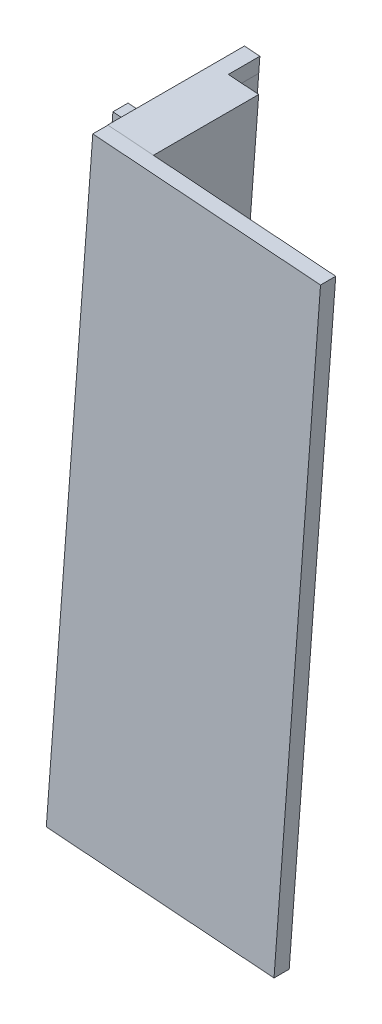
ISO-10303-21;
HEADER;
FILE_DESCRIPTION(('STEP AP214'),'2;1');
FILE_NAME('part.step','',(''),(''),'','','');
FILE_SCHEMA(('AUTOMOTIVE_DESIGN { 1 0 10303 214 1 1 1 1 }'));
ENDSEC;
DATA;
#1=APPLICATION_CONTEXT('core data for automotive mechanical design processes');
#2=APPLICATION_PROTOCOL_DEFINITION('international standard','automotive_design',2000,#1);
#3=PRODUCT_CONTEXT('',#1,'mechanical');
#4=PRODUCT('Part','Part','',(#3));
#5=PRODUCT_RELATED_PRODUCT_CATEGORY('part','',(#4));
#6=PRODUCT_DEFINITION_FORMATION('','',#4);
#7=PRODUCT_DEFINITION_CONTEXT('part definition',#1,'design');
#8=PRODUCT_DEFINITION('design','',#6,#7);
#9=PRODUCT_DEFINITION_SHAPE('','',#8);
#10=(LENGTH_UNIT() NAMED_UNIT(*) SI_UNIT(.MILLI.,.METRE.));
#11=(NAMED_UNIT(*) PLANE_ANGLE_UNIT() SI_UNIT($,.RADIAN.));
#12=(NAMED_UNIT(*) SI_UNIT($,.STERADIAN.) SOLID_ANGLE_UNIT());
#13=UNCERTAINTY_MEASURE_WITH_UNIT(LENGTH_MEASURE(1.E-05),#10,'distance_accuracy_value','');
#14=(GEOMETRIC_REPRESENTATION_CONTEXT(3) GLOBAL_UNCERTAINTY_ASSIGNED_CONTEXT((#13)) GLOBAL_UNIT_ASSIGNED_CONTEXT((#10,
#11,#12)) REPRESENTATION_CONTEXT('',''));
#15=CARTESIAN_POINT('',(0.,0.,0.));
#16=DIRECTION('',(0.,0.,1.));
#17=DIRECTION('',(1.,0.,0.));
#18=AXIS2_PLACEMENT_3D('',#15,#16,#17);
#19=CARTESIAN_POINT('',(0.,0.,0.));
#20=DIRECTION('',(0.,0.,1.));
#21=DIRECTION('',(1.,0.,0.));
#22=AXIS2_PLACEMENT_3D('',#19,#20,#21);
#23=PLANE('',#22);
#24=CARTESIAN_POINT('',(-4.41257913039612,-11.3464754526744,0.));
#25=DIRECTION('',(0.,0.,1.));
#26=DIRECTION('',(1.,0.,0.));
#27=AXIS2_PLACEMENT_3D('',#24,#25,#26);
#28=CIRCLE('',#27,2.00091326218377);
#29=CARTESIAN_POINT('',(-2.41166586821235,-11.3464754526744,0.));
#30=VERTEX_POINT('',#29);
#31=EDGE_CURVE('E390',#30,#30,#28,.T.);
#32=ORIENTED_EDGE('',*,*,#31,.T.);
#33=EDGE_LOOP('',(#32));
#34=FACE_BOUND('',#33,.T.);
#35=CARTESIAN_POINT('',(-5.84800890611934,-30.5837880858479,0.));
#36=DIRECTION('',(0.,0.,1.));
#37=DIRECTION('',(1.,0.,0.));
#38=AXIS2_PLACEMENT_3D('',#35,#36,#37);
#39=CIRCLE('',#38,2.00091326218377);
#40=CARTESIAN_POINT('',(-3.84709564393557,-30.5837880858479,0.));
#41=VERTEX_POINT('',#40);
#42=EDGE_CURVE('E384',#41,#41,#39,.T.);
#43=ORIENTED_EDGE('',*,*,#42,.T.);
#44=EDGE_LOOP('',(#43));
#45=FACE_BOUND('',#44,.T.);
#46=DIRECTION('',(-0.074410100721773,-0.997227725702899,0.));
#47=VECTOR('',#46,1.);
#48=CARTESIAN_POINT('',(1.01318336931414,-0.0756006623333213,0.));
#49=LINE('',#48,#47);
#50=CARTESIAN_POINT('',(0.937582861690444,-1.08878195826331,0.));
#51=VERTEX_POINT('',#50);
#52=CARTESIAN_POINT('',(-1.97304269494848,-40.0963424381601,0.));
#53=VERTEX_POINT('',#52);
#54=EDGE_CURVE('E284',#51,#53,#49,.T.);
#55=ORIENTED_EDGE('',*,*,#54,.T.);
#56=DIRECTION('',(-0.0744080599923074,-0.997227877973827,0.));
#57=VECTOR('',#56,1.);
#58=CARTESIAN_POINT('',(1.01310162546081,-0.0755924780991435,0.));
#59=LINE('',#58,#57);
#60=CARTESIAN_POINT('',(-2.04864128390065,-41.1095259621813,0.));
#61=VERTEX_POINT('',#60);
#62=EDGE_CURVE('E289',#53,#61,#59,.T.);
#63=ORIENTED_EDGE('',*,*,#62,.T.);
#64=DIRECTION('',(-0.997227877973828,0.0744080599922971,0.));
#65=VECTOR('',#64,1.);
#66=CARTESIAN_POINT('',(-3.06174290936103,-41.0339334840822,0.));
#67=LINE('',#66,#65);
#68=CARTESIAN_POINT('',(-3.06194083354549,-41.0339187159886,0.));
#69=VERTEX_POINT('',#68);
#70=EDGE_CURVE('E344',#61,#69,#67,.T.);
#71=ORIENTED_EDGE('',*,*,#70,.T.);
#72=DIRECTION('',(0.0744101007217726,0.997227725702899,0.));
#73=VECTOR('',#72,1.);
#74=CARTESIAN_POINT('',(-0.000113952222628581,8.50276836946742E-06,0.));
#75=LINE('',#74,#73);
#76=CARTESIAN_POINT('',(-2.60909302291886,-34.9649524345253,0.));
#77=VERTEX_POINT('',#76);
#78=EDGE_CURVE('E341',#69,#77,#75,.T.);
#79=ORIENTED_EDGE('',*,*,#78,.T.);
#80=DIRECTION('',(0.997227725702899,-0.0744101007217722,0.));
#81=VECTOR('',#80,1.);
#82=CARTESIAN_POINT('',(-2.60897907069622,-34.9649609372937,0.));
#83=LINE('',#82,#81);
#84=CARTESIAN_POINT('',(-9.70131637597284,-34.4357522925316,0.));
#85=VERTEX_POINT('',#84);
#86=EDGE_CURVE('E338',#85,#77,#83,.T.);
#87=ORIENTED_EDGE('',*,*,#86,.F.);
#88=DIRECTION('',(0.0744101007217731,0.997227725702899,0.));
#89=VECTOR('',#88,1.);
#90=CARTESIAN_POINT('',(-7.09233730527659,0.529208644762097,0.));
#91=LINE('',#90,#89);
#92=CARTESIAN_POINT('',(-9.09651089111256,-26.3302828426915,0.));
#93=VERTEX_POINT('',#92);
#94=EDGE_CURVE('E335',#85,#93,#91,.T.);
#95=ORIENTED_EDGE('',*,*,#94,.T.);
#96=DIRECTION('',(-0.997227725702899,0.0744101007217726,0.));
#97=VECTOR('',#96,1.);
#98=CARTESIAN_POINT('',(-2.00417358583596,-26.8594914874536,0.));
#99=LINE('',#98,#97);
#100=CARTESIAN_POINT('',(-2.00417358583597,-26.8594914874536,0.));
#101=VERTEX_POINT('',#100);
#102=EDGE_CURVE('E332',#101,#93,#99,.T.);
#103=ORIENTED_EDGE('',*,*,#102,.F.);
#104=DIRECTION('',(0.0744101007217729,0.997227725702899,0.));
#105=VECTOR('',#104,1.);
#106=CARTESIAN_POINT('',(0.,0.,0.));
#107=LINE('',#106,#105);
#108=CARTESIAN_POINT('',(-1.17256630016769,-15.7144744249746,0.));
#109=VERTEX_POINT('',#108);
#110=EDGE_CURVE('E329',#101,#109,#107,.T.);
#111=ORIENTED_EDGE('',*,*,#110,.T.);
#112=DIRECTION('',(0.997227725702899,-0.0744101007217731,0.));
#113=VECTOR('',#112,1.);
#114=CARTESIAN_POINT('',(-1.17256630016769,-15.7144744249747,0.));
#115=LINE('',#114,#113);
#116=CARTESIAN_POINT('',(-8.26490360544428,-15.1852657802126,0.));
#117=VERTEX_POINT('',#116);
#118=EDGE_CURVE('E326',#117,#109,#115,.T.);
#119=ORIENTED_EDGE('',*,*,#118,.F.);
#120=DIRECTION('',(0.0744101007217741,0.997227725702899,0.));
#121=VECTOR('',#120,1.);
#122=CARTESIAN_POINT('',(-7.09233730527657,0.529208644762103,0.));
#123=LINE('',#122,#121);
#124=CARTESIAN_POINT('',(-7.66009830677901,-7.0797988257169,0.));
#125=VERTEX_POINT('',#124);
#126=EDGE_CURVE('E323',#117,#125,#123,.T.);
#127=ORIENTED_EDGE('',*,*,#126,.T.);
#128=DIRECTION('',(-0.997227725702899,0.0744101007217728,0.));
#129=VECTOR('',#128,1.);
#130=CARTESIAN_POINT('',(-0.567761001502426,-7.609007470479,0.));
#131=LINE('',#130,#129);
#132=CARTESIAN_POINT('',(-0.56776100150243,-7.609007470479,0.));
#133=VERTEX_POINT('',#132);
#134=EDGE_CURVE('E320',#133,#125,#131,.T.);
#135=ORIENTED_EDGE('',*,*,#134,.F.);
#136=DIRECTION('',(0.0744101007217734,0.997227725702899,0.));
#137=VECTOR('',#136,1.);
#138=CARTESIAN_POINT('',(0.,0.,0.));
#139=LINE('',#138,#137);
#140=CARTESIAN_POINT('',(0.,0.,0.));
#141=VERTEX_POINT('',#140);
#142=EDGE_CURVE('E317',#133,#141,#139,.T.);
#143=ORIENTED_EDGE('',*,*,#142,.T.);
#144=DIRECTION('',(0.997227877974218,-0.074408059987068,0.));
#145=VECTOR('',#144,1.);
#146=CARTESIAN_POINT('',(0.,0.,0.));
#147=LINE('',#146,#145);
#148=CARTESIAN_POINT('',(1.01318145063731,-0.0755984342414808,0.));
#149=VERTEX_POINT('',#148);
#150=EDGE_CURVE('E314',#141,#149,#147,.T.);
#151=ORIENTED_EDGE('',*,*,#150,.T.);
#152=DIRECTION('',(0.0744080599870683,0.997227877974218,0.));
#153=VECTOR('',#152,1.);
#154=CARTESIAN_POINT('',(1.01318145063731,-0.0755984342414811,0.));
#155=LINE('',#154,#153);
#156=EDGE_CURVE('E312',#51,#149,#155,.T.);
#157=ORIENTED_EDGE('',*,*,#156,.F.);
#158=EDGE_LOOP('',(#55,#63,#71,#79,#87,#95,#103,#111,#119,#127,#135,#143,#151,#157));
#159=FACE_BOUND('',#158,.T.);
#160=ADVANCED_FACE('F37',(#34,#45,#159),#23,.F.);
#161=CARTESIAN_POINT('',(0.,0.,9.));
#162=DIRECTION('',(0.,0.,1.));
#163=DIRECTION('',(1.,0.,0.));
#164=AXIS2_PLACEMENT_3D('',#161,#162,#163);
#165=PLANE('',#164);
#166=DIRECTION('',(-0.997227877973828,0.0744080599922971,0.));
#167=VECTOR('',#166,1.);
#168=CARTESIAN_POINT('',(-3.06174290936103,-41.0339334840822,9.));
#169=LINE('',#168,#167);
#170=CARTESIAN_POINT('',(-3.04587108298389,-41.0351157067502,9.));
#171=VERTEX_POINT('',#170);
#172=CARTESIAN_POINT('',(-3.06194083354549,-41.0339187159886,9.));
#173=VERTEX_POINT('',#172);
#174=EDGE_CURVE('E305',#171,#173,#169,.T.);
#175=ORIENTED_EDGE('',*,*,#174,.F.);
#176=DIRECTION('',(0.0744101007217574,0.9972277257029,0.));
#177=VECTOR('',#176,1.);
#178=CARTESIAN_POINT('',(-3.04587108298389,-41.0351157067502,9.));
#179=LINE('',#178,#177);
#180=CARTESIAN_POINT('',(0.0159556460476203,-0.0011905289598001,9.));
#181=VERTEX_POINT('',#180);
#182=EDGE_CURVE('E242',#171,#181,#179,.T.);
#183=ORIENTED_EDGE('',*,*,#182,.T.);
#184=DIRECTION('',(0.997227877974218,-0.074408059987068,0.));
#185=VECTOR('',#184,1.);
#186=CARTESIAN_POINT('',(0.,0.,9.));
#187=LINE('',#186,#185);
#188=CARTESIAN_POINT('',(0.,0.,9.));
#189=VERTEX_POINT('',#188);
#190=EDGE_CURVE('E285',#189,#181,#187,.T.);
#191=ORIENTED_EDGE('',*,*,#190,.F.);
#192=DIRECTION('',(0.0744101007217734,0.997227725702899,0.));
#193=VECTOR('',#192,1.);
#194=CARTESIAN_POINT('',(0.,0.,9.));
#195=LINE('',#194,#193);
#196=CARTESIAN_POINT('',(-0.56776100150243,-7.609007470479,9.));
#197=VERTEX_POINT('',#196);
#198=EDGE_CURVE('E288',#197,#189,#195,.T.);
#199=ORIENTED_EDGE('',*,*,#198,.F.);
#200=DIRECTION('',(-0.997227725702899,0.0744101007217728,0.));
#201=VECTOR('',#200,1.);
#202=CARTESIAN_POINT('',(-0.567761001502426,-7.609007470479,9.));
#203=LINE('',#202,#201);
#204=CARTESIAN_POINT('',(-0.567874953725064,-7.60899896771063,9.));
#205=VERTEX_POINT('',#204);
#206=EDGE_CURVE('E292',#197,#205,#203,.T.);
#207=ORIENTED_EDGE('',*,*,#206,.T.);
#208=DIRECTION('',(-0.0744101007217722,-0.997227725702899,0.));
#209=VECTOR('',#208,1.);
#210=CARTESIAN_POINT('',(-0.000113952222642852,8.50276837053229E-06,9.));
#211=LINE('',#210,#209);
#212=CARTESIAN_POINT('',(-1.17268025239032,-15.7144659222063,9.));
#213=VERTEX_POINT('',#212);
#214=EDGE_CURVE('E11',#205,#213,#211,.T.);
#215=ORIENTED_EDGE('',*,*,#214,.T.);
#216=DIRECTION('',(0.997227725702899,-0.0744101007217731,0.));
#217=VECTOR('',#216,1.);
#218=CARTESIAN_POINT('',(-1.17256630016769,-15.7144744249747,9.));
#219=LINE('',#218,#217);
#220=CARTESIAN_POINT('',(-1.17256630016769,-15.7144744249746,9.));
#221=VERTEX_POINT('',#220);
#222=EDGE_CURVE('E295',#213,#221,#219,.T.);
#223=ORIENTED_EDGE('',*,*,#222,.T.);
#224=DIRECTION('',(0.0744101007217729,0.997227725702899,0.));
#225=VECTOR('',#224,1.);
#226=CARTESIAN_POINT('',(0.,0.,9.));
#227=LINE('',#226,#225);
#228=CARTESIAN_POINT('',(-2.00417358583597,-26.8594914874536,9.));
#229=VERTEX_POINT('',#228);
#230=EDGE_CURVE('E297',#229,#221,#227,.T.);
#231=ORIENTED_EDGE('',*,*,#230,.F.);
#232=DIRECTION('',(-0.997227725702899,0.0744101007217726,0.));
#233=VECTOR('',#232,1.);
#234=CARTESIAN_POINT('',(-2.00417358583596,-26.8594914874536,9.));
#235=LINE('',#234,#233);
#236=CARTESIAN_POINT('',(-2.00428753805859,-26.8594829846853,9.));
#237=VERTEX_POINT('',#236);
#238=EDGE_CURVE('E300',#229,#237,#235,.T.);
#239=ORIENTED_EDGE('',*,*,#238,.T.);
#240=DIRECTION('',(0.0744101007217726,0.997227725702899,0.));
#241=VECTOR('',#240,1.);
#242=CARTESIAN_POINT('',(-0.000113952222628581,8.50276836946742E-06,9.));
#243=LINE('',#242,#241);
#244=EDGE_CURVE('E303',#173,#237,#243,.T.);
#245=ORIENTED_EDGE('',*,*,#244,.F.);
#246=EDGE_LOOP('',(#175,#183,#191,#199,#207,#215,#223,#231,#239,#245));
#247=FACE_BOUND('',#246,.T.);
#248=ADVANCED_FACE('F434',(#247),#165,.T.);
#249=CARTESIAN_POINT('',(-0.567761001502426,-7.609007470479,9.));
#250=DIRECTION('',(-0.0744101007217728,-0.997227725702899,0.));
#251=DIRECTION('',(0.997227725702899,-0.0744101007217728,0.));
#252=AXIS2_PLACEMENT_3D('',#249,#250,#251);
#253=PLANE('',#252);
#254=DIRECTION('',(-0.997227725702899,0.0744101007217728,0.));
#255=VECTOR('',#254,1.);
#256=CARTESIAN_POINT('',(-0.567761001502426,-7.609007470479,0.999999999999999));
#257=LINE('',#256,#255);
#258=CARTESIAN_POINT('',(-0.567874953725064,-7.60899896771063,0.999999999999999));
#259=VERTEX_POINT('',#258);
#260=CARTESIAN_POINT('',(-7.66009830677901,-7.0797988257169,0.999999999999999));
#261=VERTEX_POINT('',#260);
#262=EDGE_CURVE('E282',#259,#261,#257,.T.);
#263=ORIENTED_EDGE('',*,*,#262,.F.);
#264=DIRECTION('',(0.,0.,-1.));
#265=VECTOR('',#264,1.);
#266=CARTESIAN_POINT('',(-0.567874953725064,-7.60899896771063,9.));
#267=LINE('',#266,#265);
#268=EDGE_CURVE('E268',#205,#259,#267,.T.);
#269=ORIENTED_EDGE('',*,*,#268,.F.);
#270=ORIENTED_EDGE('',*,*,#206,.F.);
#271=DIRECTION('',(0.,0.,-1.));
#272=VECTOR('',#271,1.);
#273=CARTESIAN_POINT('',(-0.56776100150243,-7.609007470479,9.));
#274=LINE('',#273,#272);
#275=EDGE_CURVE('E368',#197,#133,#274,.T.);
#276=ORIENTED_EDGE('',*,*,#275,.T.);
#277=ORIENTED_EDGE('',*,*,#134,.T.);
#278=DIRECTION('',(0.,0.,-1.));
#279=VECTOR('',#278,1.);
#280=CARTESIAN_POINT('',(-7.66009830677901,-7.0797988257169,9.));
#281=LINE('',#280,#279);
#282=EDGE_CURVE('E366',#261,#125,#281,.T.);
#283=ORIENTED_EDGE('',*,*,#282,.F.);
#284=EDGE_LOOP('',(#263,#269,#270,#276,#277,#283));
#285=FACE_BOUND('',#284,.T.);
#286=ADVANCED_FACE('F418',(#285),#253,.F.);
#287=CARTESIAN_POINT('',(-7.09233730527657,0.529208644762103,9.));
#288=DIRECTION('',(-0.997227725702899,0.0744101007217741,0.));
#289=DIRECTION('',(-0.0744101007217741,-0.997227725702899,0.));
#290=AXIS2_PLACEMENT_3D('',#287,#288,#289);
#291=PLANE('',#290);
#292=DIRECTION('',(0.,0.,-1.));
#293=VECTOR('',#292,1.);
#294=CARTESIAN_POINT('',(-8.26490360544428,-15.1852657802126,9.));
#295=LINE('',#294,#293);
#296=CARTESIAN_POINT('',(-8.26490360544428,-15.1852657802126,0.999999999999999));
#297=VERTEX_POINT('',#296);
#298=EDGE_CURVE('E364',#297,#117,#295,.T.);
#299=ORIENTED_EDGE('',*,*,#298,.F.);
#300=DIRECTION('',(0.0744101007217741,0.997227725702899,0.));
#301=VECTOR('',#300,1.);
#302=CARTESIAN_POINT('',(-7.09233730527657,0.529208644762103,0.999999999999999));
#303=LINE('',#302,#301);
#304=EDGE_CURVE('E279',#297,#261,#303,.T.);
#305=ORIENTED_EDGE('',*,*,#304,.T.);
#306=ORIENTED_EDGE('',*,*,#282,.T.);
#307=ORIENTED_EDGE('',*,*,#126,.F.);
#308=EDGE_LOOP('',(#299,#305,#306,#307));
#309=FACE_BOUND('',#308,.T.);
#310=ADVANCED_FACE('F416',(#309),#291,.T.);
#311=CARTESIAN_POINT('',(-1.17256630016769,-15.7144744249747,9.));
#312=DIRECTION('',(0.0744101007217731,0.997227725702899,0.));
#313=DIRECTION('',(-0.997227725702899,0.0744101007217731,0.));
#314=AXIS2_PLACEMENT_3D('',#311,#312,#313);
#315=PLANE('',#314);
#316=DIRECTION('',(0.997227725702899,-0.0744101007217731,0.));
#317=VECTOR('',#316,1.);
#318=CARTESIAN_POINT('',(-1.17256630016769,-15.7144744249747,0.999999999999999));
#319=LINE('',#318,#317);
#320=CARTESIAN_POINT('',(-1.17268025239032,-15.7144659222063,0.999999999999999));
#321=VERTEX_POINT('',#320);
#322=EDGE_CURVE('E277',#297,#321,#319,.T.);
#323=ORIENTED_EDGE('',*,*,#322,.F.);
#324=ORIENTED_EDGE('',*,*,#298,.T.);
#325=ORIENTED_EDGE('',*,*,#118,.T.);
#326=DIRECTION('',(0.,0.,-1.));
#327=VECTOR('',#326,1.);
#328=CARTESIAN_POINT('',(-1.17256630016769,-15.7144744249746,9.));
#329=LINE('',#328,#327);
#330=EDGE_CURVE('E362',#221,#109,#329,.T.);
#331=ORIENTED_EDGE('',*,*,#330,.F.);
#332=ORIENTED_EDGE('',*,*,#222,.F.);
#333=DIRECTION('',(0.,0.,1.));
#334=VECTOR('',#333,1.);
#335=CARTESIAN_POINT('',(-1.17268025239032,-15.7144659222063,9.));
#336=LINE('',#335,#334);
#337=EDGE_CURVE('E266',#321,#213,#336,.T.);
#338=ORIENTED_EDGE('',*,*,#337,.F.);
#339=EDGE_LOOP('',(#323,#324,#325,#331,#332,#338));
#340=FACE_BOUND('',#339,.T.);
#341=ADVANCED_FACE('F427',(#340),#315,.F.);
#342=CARTESIAN_POINT('',(-2.00417358583596,-26.8594914874536,9.));
#343=DIRECTION('',(-0.0744101007217726,-0.997227725702899,0.));
#344=DIRECTION('',(0.997227725702899,-0.0744101007217726,0.));
#345=AXIS2_PLACEMENT_3D('',#342,#343,#344);
#346=PLANE('',#345);
#347=DIRECTION('',(-0.997227725702899,0.0744101007217726,0.));
#348=VECTOR('',#347,1.);
#349=CARTESIAN_POINT('',(-2.00417358583596,-26.8594914874536,0.999999999999999));
#350=LINE('',#349,#348);
#351=CARTESIAN_POINT('',(-2.00428753805859,-26.8594829846853,0.999999999999999));
#352=VERTEX_POINT('',#351);
#353=CARTESIAN_POINT('',(-9.09651089111256,-26.3302828426915,0.999999999999999));
#354=VERTEX_POINT('',#353);
#355=EDGE_CURVE('E275',#352,#354,#350,.T.);
#356=ORIENTED_EDGE('',*,*,#355,.F.);
#357=DIRECTION('',(0.,0.,-1.));
#358=VECTOR('',#357,1.);
#359=CARTESIAN_POINT('',(-2.00428753805859,-26.8594829846853,9.));
#360=LINE('',#359,#358);
#361=EDGE_CURVE('E264',#237,#352,#360,.T.);
#362=ORIENTED_EDGE('',*,*,#361,.F.);
#363=ORIENTED_EDGE('',*,*,#238,.F.);
#364=DIRECTION('',(0.,0.,-1.));
#365=VECTOR('',#364,1.);
#366=CARTESIAN_POINT('',(-2.00417358583597,-26.8594914874536,9.));
#367=LINE('',#366,#365);
#368=EDGE_CURVE('E360',#229,#101,#367,.T.);
#369=ORIENTED_EDGE('',*,*,#368,.T.);
#370=ORIENTED_EDGE('',*,*,#102,.T.);
#371=DIRECTION('',(0.,0.,-1.));
#372=VECTOR('',#371,1.);
#373=CARTESIAN_POINT('',(-9.09651089111256,-26.3302828426915,9.));
#374=LINE('',#373,#372);
#375=EDGE_CURVE('E358',#354,#93,#374,.T.);
#376=ORIENTED_EDGE('',*,*,#375,.F.);
#377=EDGE_LOOP('',(#356,#362,#363,#369,#370,#376));
#378=FACE_BOUND('',#377,.T.);
#379=ADVANCED_FACE('F496',(#378),#346,.F.);
#380=CARTESIAN_POINT('',(-7.09233730527659,0.529208644762097,9.));
#381=DIRECTION('',(-0.997227725702899,0.0744101007217731,0.));
#382=DIRECTION('',(-0.0744101007217731,-0.997227725702899,0.));
#383=AXIS2_PLACEMENT_3D('',#380,#381,#382);
#384=PLANE('',#383);
#385=DIRECTION('',(0.,0.,-1.));
#386=VECTOR('',#385,1.);
#387=CARTESIAN_POINT('',(-9.70131637597284,-34.4357522925316,9.));
#388=LINE('',#387,#386);
#389=CARTESIAN_POINT('',(-9.70131637597284,-34.4357522925316,0.999999999999999));
#390=VERTEX_POINT('',#389);
#391=EDGE_CURVE('E356',#390,#85,#388,.T.);
#392=ORIENTED_EDGE('',*,*,#391,.F.);
#393=DIRECTION('',(0.0744101007217731,0.997227725702899,0.));
#394=VECTOR('',#393,1.);
#395=CARTESIAN_POINT('',(-7.09233730527659,0.529208644762097,0.999999999999999));
#396=LINE('',#395,#394);
#397=EDGE_CURVE('E272',#390,#354,#396,.T.);
#398=ORIENTED_EDGE('',*,*,#397,.T.);
#399=ORIENTED_EDGE('',*,*,#375,.T.);
#400=ORIENTED_EDGE('',*,*,#94,.F.);
#401=EDGE_LOOP('',(#392,#398,#399,#400));
#402=FACE_BOUND('',#401,.T.);
#403=ADVANCED_FACE('F492',(#402),#384,.T.);
#404=CARTESIAN_POINT('',(-2.60897907069622,-34.9649609372937,9.));
#405=DIRECTION('',(0.0744101007217722,0.997227725702899,0.));
#406=DIRECTION('',(-0.997227725702899,0.0744101007217722,0.));
#407=AXIS2_PLACEMENT_3D('',#404,#405,#406);
#408=PLANE('',#407);
#409=DIRECTION('',(0.997227725702899,-0.0744101007217722,0.));
#410=VECTOR('',#409,1.);
#411=CARTESIAN_POINT('',(-2.60897907069622,-34.9649609372937,0.999999999999999));
#412=LINE('',#411,#410);
#413=CARTESIAN_POINT('',(-2.60909302291886,-34.9649524345253,0.999999999999999));
#414=VERTEX_POINT('',#413);
#415=EDGE_CURVE('E270',#390,#414,#412,.T.);
#416=ORIENTED_EDGE('',*,*,#415,.F.);
#417=ORIENTED_EDGE('',*,*,#391,.T.);
#418=ORIENTED_EDGE('',*,*,#86,.T.);
#419=DIRECTION('',(0.,0.,-1.));
#420=VECTOR('',#419,1.);
#421=CARTESIAN_POINT('',(-2.60909302291886,-34.9649524345253,9.));
#422=LINE('',#421,#420);
#423=EDGE_CURVE('E354',#414,#77,#422,.T.);
#424=ORIENTED_EDGE('',*,*,#423,.F.);
#425=EDGE_LOOP('',(#416,#417,#418,#424));
#426=FACE_BOUND('',#425,.T.);
#427=ADVANCED_FACE('F489',(#426),#408,.F.);
#428=CARTESIAN_POINT('',(1.01318336931414,-0.0756006623333213,9.));
#429=DIRECTION('',(0.997227725702899,-0.0744101007217729,0.));
#430=DIRECTION('',(0.074410100721773,0.997227725702899,0.));
#431=AXIS2_PLACEMENT_3D('',#428,#429,#430);
#432=PLANE('',#431);
#433=DIRECTION('',(-0.0744101007217574,-0.9972277257029,0.));
#434=VECTOR('',#433,1.);
#435=CARTESIAN_POINT('',(1.01318336931415,-0.0756006623333057,2.07236772052555));
#436=LINE('',#435,#434);
#437=CARTESIAN_POINT('',(0.937582861690444,-1.08878195826331,2.07236772052554));
#438=VERTEX_POINT('',#437);
#439=CARTESIAN_POINT('',(-1.97304269494848,-40.0963424381601,2.07236772052554));
#440=VERTEX_POINT('',#439);
#441=EDGE_CURVE('E225',#438,#440,#436,.T.);
#442=ORIENTED_EDGE('',*,*,#441,.T.);
#443=DIRECTION('',(0.,0.,-1.));
#444=VECTOR('',#443,1.);
#445=CARTESIAN_POINT('',(-1.97304269494848,-40.0963424381601,9.));
#446=LINE('',#445,#444);
#447=EDGE_CURVE('E309',#440,#53,#446,.T.);
#448=ORIENTED_EDGE('',*,*,#447,.T.);
#449=ORIENTED_EDGE('',*,*,#54,.F.);
#450=DIRECTION('',(0.,0.,-1.));
#451=VECTOR('',#450,1.);
#452=CARTESIAN_POINT('',(0.937582861690444,-1.08878195826331,9.));
#453=LINE('',#452,#451);
#454=EDGE_CURVE('E45',#438,#51,#453,.T.);
#455=ORIENTED_EDGE('',*,*,#454,.F.);
#456=EDGE_LOOP('',(#442,#448,#449,#455));
#457=FACE_BOUND('',#456,.T.);
#458=ADVANCED_FACE('F39',(#457),#432,.T.);
#459=CARTESIAN_POINT('',(1.01318145063731,-0.0755984342414811,9.));
#460=DIRECTION('',(-0.997227877974218,0.0744080599870683,0.));
#461=DIRECTION('',(-0.0744080599870683,-0.997227877974218,0.));
#462=AXIS2_PLACEMENT_3D('',#459,#460,#461);
#463=PLANE('',#462);
#464=DIRECTION('',(0.,0.,-1.));
#465=VECTOR('',#464,1.);
#466=CARTESIAN_POINT('',(1.01318145063731,-0.0755984342414808,9.));
#467=LINE('',#466,#465);
#468=CARTESIAN_POINT('',(1.01318145063731,-0.0755984342414808,2.07236772052554));
#469=VERTEX_POINT('',#468);
#470=EDGE_CURVE('E57',#469,#149,#467,.T.);
#471=ORIENTED_EDGE('',*,*,#470,.F.);
#472=EDGE_CURVE('E52',#469,#438,#436,.T.);
#473=ORIENTED_EDGE('',*,*,#472,.T.);
#474=ORIENTED_EDGE('',*,*,#454,.T.);
#475=ORIENTED_EDGE('',*,*,#156,.T.);
#476=EDGE_LOOP('',(#471,#473,#474,#475));
#477=FACE_BOUND('',#476,.T.);
#478=ADVANCED_FACE('F373',(#477),#463,.F.);
#479=CARTESIAN_POINT('',(0.,0.,9.));
#480=DIRECTION('',(0.074408059987068,0.997227877974218,0.));
#481=DIRECTION('',(-0.997227877974218,0.074408059987068,0.));
#482=AXIS2_PLACEMENT_3D('',#479,#480,#481);
#483=PLANE('',#482);
#484=ORIENTED_EDGE('',*,*,#150,.F.);
#485=DIRECTION('',(0.,0.,-1.));
#486=VECTOR('',#485,1.);
#487=CARTESIAN_POINT('',(0.,0.,9.));
#488=LINE('',#487,#486);
#489=EDGE_CURVE('E370',#189,#141,#488,.T.);
#490=ORIENTED_EDGE('',*,*,#489,.F.);
#491=ORIENTED_EDGE('',*,*,#190,.T.);
#492=DIRECTION('',(0.9972277257029,-0.0744101007217575,0.));
#493=VECTOR('',#492,1.);
#494=CARTESIAN_POINT('',(0.0159557983207095,-0.00118848822950487,9.));
#495=LINE('',#494,#493);
#496=CARTESIAN_POINT('',(3.00763897542941,-0.224418790394777,9.));
#497=VERTEX_POINT('',#496);
#498=EDGE_CURVE('E257',#181,#497,#495,.T.);
#499=ORIENTED_EDGE('',*,*,#498,.T.);
#500=DIRECTION('',(0.,0.,-1.));
#501=VECTOR('',#500,1.);
#502=CARTESIAN_POINT('',(3.00763897542941,-0.224418790394777,0.));
#503=LINE('',#502,#501);
#504=CARTESIAN_POINT('',(3.00763897542941,-0.224418790394777,2.07236772052555));
#505=VERTEX_POINT('',#504);
#506=EDGE_CURVE('E218',#497,#505,#503,.T.);
#507=ORIENTED_EDGE('',*,*,#506,.T.);
#508=DIRECTION('',(-0.9972277257029,0.0744101007217575,0.));
#509=VECTOR('',#508,1.);
#510=CARTESIAN_POINT('',(3.00763897542941,-0.224418790394777,2.07236772052555));
#511=LINE('',#510,#509);
#512=EDGE_CURVE('E215',#505,#469,#511,.T.);
#513=ORIENTED_EDGE('',*,*,#512,.T.);
#514=ORIENTED_EDGE('',*,*,#470,.T.);
#515=EDGE_LOOP('',(#484,#490,#491,#499,#507,#513,#514));
#516=FACE_BOUND('',#515,.T.);
#517=ADVANCED_FACE('F439',(#516),#483,.T.);
#518=CARTESIAN_POINT('',(0.,0.,9.));
#519=DIRECTION('',(-0.997227725702899,0.0744101007217734,0.));
#520=DIRECTION('',(-0.0744101007217734,-0.997227725702899,0.));
#521=AXIS2_PLACEMENT_3D('',#518,#519,#520);
#522=PLANE('',#521);
#523=ORIENTED_EDGE('',*,*,#142,.F.);
#524=ORIENTED_EDGE('',*,*,#275,.F.);
#525=ORIENTED_EDGE('',*,*,#198,.T.);
#526=ORIENTED_EDGE('',*,*,#489,.T.);
#527=EDGE_LOOP('',(#523,#524,#525,#526));
#528=FACE_BOUND('',#527,.T.);
#529=ADVANCED_FACE('F437',(#528),#522,.T.);
#530=CARTESIAN_POINT('',(0.,0.,9.));
#531=DIRECTION('',(-0.997227725702899,0.0744101007217729,0.));
#532=DIRECTION('',(-0.0744101007217729,-0.997227725702899,0.));
#533=AXIS2_PLACEMENT_3D('',#530,#531,#532);
#534=PLANE('',#533);
#535=ORIENTED_EDGE('',*,*,#110,.F.);
#536=ORIENTED_EDGE('',*,*,#368,.F.);
#537=ORIENTED_EDGE('',*,*,#230,.T.);
#538=ORIENTED_EDGE('',*,*,#330,.T.);
#539=EDGE_LOOP('',(#535,#536,#537,#538));
#540=FACE_BOUND('',#539,.T.);
#541=ADVANCED_FACE('F487',(#540),#534,.T.);
#542=CARTESIAN_POINT('',(-0.000113952222628581,8.50276836946742E-06,9.));
#543=DIRECTION('',(-0.997227725702899,0.0744101007217726,0.));
#544=DIRECTION('',(-0.0744101007217726,-0.997227725702899,0.));
#545=AXIS2_PLACEMENT_3D('',#542,#543,#544);
#546=PLANE('',#545);
#547=ORIENTED_EDGE('',*,*,#244,.T.);
#548=ORIENTED_EDGE('',*,*,#361,.T.);
#549=DIRECTION('',(0.0744101007217722,0.997227725702899,0.));
#550=VECTOR('',#549,1.);
#551=CARTESIAN_POINT('',(-3.10431249307104,-41.6017743330764,0.999999999999999));
#552=LINE('',#551,#550);
#553=EDGE_CURVE('E263',#414,#352,#552,.T.);
#554=ORIENTED_EDGE('',*,*,#553,.F.);
#555=ORIENTED_EDGE('',*,*,#423,.T.);
#556=ORIENTED_EDGE('',*,*,#78,.F.);
#557=DIRECTION('',(0.,0.,-1.));
#558=VECTOR('',#557,1.);
#559=CARTESIAN_POINT('',(-3.06194083354549,-41.0339187159886,9.));
#560=LINE('',#559,#558);
#561=EDGE_CURVE('E352',#173,#69,#560,.T.);
#562=ORIENTED_EDGE('',*,*,#561,.F.);
#563=EDGE_LOOP('',(#547,#548,#554,#555,#556,#562));
#564=FACE_BOUND('',#563,.T.);
#565=ADVANCED_FACE('F484',(#564),#546,.T.);
#566=CARTESIAN_POINT('',(-3.06174290936103,-41.0339334840822,9.));
#567=DIRECTION('',(-0.0744080599922971,-0.997227877973827,0.));
#568=DIRECTION('',(0.997227877973828,-0.0744080599922971,0.));
#569=AXIS2_PLACEMENT_3D('',#566,#567,#568);
#570=PLANE('',#569);
#571=ORIENTED_EDGE('',*,*,#70,.F.);
#572=DIRECTION('',(0.,0.,-1.));
#573=VECTOR('',#572,1.);
#574=CARTESIAN_POINT('',(-2.04864128390065,-41.1095259621813,9.));
#575=LINE('',#574,#573);
#576=CARTESIAN_POINT('',(-2.04864128390065,-41.1095259621813,2.07236772052554));
#577=VERTEX_POINT('',#576);
#578=EDGE_CURVE('E350',#577,#61,#575,.T.);
#579=ORIENTED_EDGE('',*,*,#578,.F.);
#580=CARTESIAN_POINT('',(-2.04864128390065,-41.1095259621813,9.));
#581=VERTEX_POINT('',#580);
#582=EDGE_CURVE('E211',#581,#577,#575,.T.);
#583=ORIENTED_EDGE('',*,*,#582,.F.);
#584=EDGE_CURVE('E306',#581,#171,#169,.T.);
#585=ORIENTED_EDGE('',*,*,#584,.T.);
#586=ORIENTED_EDGE('',*,*,#174,.T.);
#587=ORIENTED_EDGE('',*,*,#561,.T.);
#588=EDGE_LOOP('',(#571,#579,#583,#585,#586,#587));
#589=FACE_BOUND('',#588,.T.);
#590=ADVANCED_FACE('F453',(#589),#570,.T.);
#591=CARTESIAN_POINT('',(1.01310162546081,-0.0755924780991435,9.));
#592=DIRECTION('',(0.997227877973827,-0.0744080599923074,0.));
#593=DIRECTION('',(0.0744080599923074,0.997227877973827,0.));
#594=AXIS2_PLACEMENT_3D('',#591,#592,#593);
#595=PLANE('',#594);
#596=EDGE_CURVE('E226',#440,#577,#436,.T.);
#597=ORIENTED_EDGE('',*,*,#596,.T.);
#598=ORIENTED_EDGE('',*,*,#578,.T.);
#599=ORIENTED_EDGE('',*,*,#62,.F.);
#600=ORIENTED_EDGE('',*,*,#447,.F.);
#601=EDGE_LOOP('',(#597,#598,#599,#600));
#602=FACE_BOUND('',#601,.T.);
#603=ADVANCED_FACE('F382',(#602),#595,.T.);
#604=CARTESIAN_POINT('',(-3.1041985408484,-41.6017828358447,0.999999999999999));
#605=DIRECTION('',(0.,0.,1.));
#606=DIRECTION('',(1.,0.,0.));
#607=AXIS2_PLACEMENT_3D('',#604,#605,#606);
#608=PLANE('',#607);
#609=CARTESIAN_POINT('',(-5.84800890611934,-30.5837880858479,0.999999999999999));
#610=DIRECTION('',(0.,0.,1.));
#611=DIRECTION('',(1.,0.,0.));
#612=AXIS2_PLACEMENT_3D('',#609,#610,#611);
#613=CIRCLE('',#612,2.8702);
#614=CARTESIAN_POINT('',(-2.97780890611934,-30.5837880858479,0.999999999999999));
#615=VERTEX_POINT('',#614);
#616=EDGE_CURVE('E386',#615,#615,#613,.T.);
#617=ORIENTED_EDGE('',*,*,#616,.F.);
#618=EDGE_LOOP('',(#617));
#619=FACE_BOUND('',#618,.T.);
#620=ORIENTED_EDGE('',*,*,#355,.T.);
#621=ORIENTED_EDGE('',*,*,#397,.F.);
#622=ORIENTED_EDGE('',*,*,#415,.T.);
#623=ORIENTED_EDGE('',*,*,#553,.T.);
#624=EDGE_LOOP('',(#620,#621,#622,#623));
#625=FACE_BOUND('',#624,.T.);
#626=ADVANCED_FACE('F406',(#619,#625),#608,.T.);
#627=CARTESIAN_POINT('',(-4.41257913039612,-11.3464754526744,0.999999999999999));
#628=DIRECTION('',(0.,0.,1.));
#629=DIRECTION('',(1.,0.,0.));
#630=AXIS2_PLACEMENT_3D('',#627,#628,#629);
#631=CIRCLE('',#630,2.8702);
#632=CARTESIAN_POINT('',(-1.54237913039612,-11.3464754526744,0.999999999999999));
#633=VERTEX_POINT('',#632);
#634=EDGE_CURVE('E395',#633,#633,#631,.T.);
#635=ORIENTED_EDGE('',*,*,#634,.F.);
#636=EDGE_LOOP('',(#635));
#637=FACE_BOUND('',#636,.T.);
#638=ORIENTED_EDGE('',*,*,#262,.T.);
#639=ORIENTED_EDGE('',*,*,#304,.F.);
#640=ORIENTED_EDGE('',*,*,#322,.T.);
#641=EDGE_CURVE('E254',#321,#259,#552,.T.);
#642=ORIENTED_EDGE('',*,*,#641,.T.);
#643=EDGE_LOOP('',(#638,#639,#640,#642));
#644=FACE_BOUND('',#643,.T.);
#645=ADVANCED_FACE('F402',(#637,#644),#608,.T.);
#646=CARTESIAN_POINT('',(-3.10431249307104,-41.6017743330764,0.));
#647=DIRECTION('',(-0.997227725702899,0.0744101007217722,0.));
#648=DIRECTION('',(-0.0744101007217722,-0.997227725702899,0.));
#649=AXIS2_PLACEMENT_3D('',#646,#647,#648);
#650=PLANE('',#649);
#651=ORIENTED_EDGE('',*,*,#268,.T.);
#652=ORIENTED_EDGE('',*,*,#641,.F.);
#653=ORIENTED_EDGE('',*,*,#337,.T.);
#654=ORIENTED_EDGE('',*,*,#214,.F.);
#655=EDGE_LOOP('',(#651,#652,#653,#654));
#656=FACE_BOUND('',#655,.T.);
#657=ADVANCED_FACE('F405',(#656),#650,.T.);
#658=CARTESIAN_POINT('',(-3.04587108298389,-41.0351157067502,9.));
#659=DIRECTION('',(0.,0.,-1.));
#660=DIRECTION('',(-1.,0.,0.));
#661=AXIS2_PLACEMENT_3D('',#658,#659,#660);
#662=PLANE('',#661);
#663=DIRECTION('',(-0.0744101007217574,-0.9972277257029,0.));
#664=VECTOR('',#663,1.);
#665=CARTESIAN_POINT('',(3.00763882071994,-0.22442086377682,9.));
#666=LINE('',#665,#664);
#667=CARTESIAN_POINT('',(-0.0541879058752063,-41.2583460089155,9.));
#668=VERTEX_POINT('',#667);
#669=EDGE_CURVE('E203',#497,#668,#666,.T.);
#670=ORIENTED_EDGE('',*,*,#669,.F.);
#671=CARTESIAN_POINT('',(15.0062829710867,-1.11972112227896,9.));
#672=VERTEX_POINT('',#671);
#673=EDGE_CURVE('E258',#497,#672,#495,.T.);
#674=ORIENTED_EDGE('',*,*,#673,.T.);
#675=DIRECTION('',(0.0744101007217574,0.9972277257029,0.));
#676=VECTOR('',#675,1.);
#677=CARTESIAN_POINT('',(11.9444560897821,-42.1536483407997,9.));
#678=LINE('',#677,#676);
#679=CARTESIAN_POINT('',(11.9444560897821,-42.1536483407997,9.));
#680=VERTEX_POINT('',#679);
#681=EDGE_CURVE('E230',#680,#672,#678,.T.);
#682=ORIENTED_EDGE('',*,*,#681,.F.);
#683=DIRECTION('',(0.9972277257029,-0.0744101007217575,0.));
#684=VECTOR('',#683,1.);
#685=CARTESIAN_POINT('',(-3.04587108298389,-41.0351157067502,9.));
#686=LINE('',#685,#684);
#687=EDGE_CURVE('E251',#668,#680,#686,.T.);
#688=ORIENTED_EDGE('',*,*,#687,.F.);
#689=EDGE_LOOP('',(#670,#674,#682,#688));
#690=FACE_BOUND('',#689,.T.);
#691=ADVANCED_FACE('F462',(#690),#662,.T.);
#692=CARTESIAN_POINT('',(-3.04587108298389,-41.0351157067502,9.));
#693=DIRECTION('',(-0.0744101007217575,-0.9972277257029,0.));
#694=DIRECTION('',(0.9972277257029,-0.0744101007217575,0.));
#695=AXIS2_PLACEMENT_3D('',#692,#693,#694);
#696=PLANE('',#695);
#697=ORIENTED_EDGE('',*,*,#584,.F.);
#698=ORIENTED_EDGE('',*,*,#582,.T.);
#699=DIRECTION('',(-0.9972277257029,0.0744101007217575,0.));
#700=VECTOR('',#699,1.);
#701=CARTESIAN_POINT('',(-0.0541879058751911,-41.2583460089155,2.07236772052554));
#702=LINE('',#701,#700);
#703=CARTESIAN_POINT('',(-0.0541879058751911,-41.2583460089155,2.07236772052554));
#704=VERTEX_POINT('',#703);
#705=EDGE_CURVE('E208',#704,#577,#702,.T.);
#706=ORIENTED_EDGE('',*,*,#705,.F.);
#707=DIRECTION('',(0.,0.,-1.));
#708=VECTOR('',#707,1.);
#709=CARTESIAN_POINT('',(-0.0541879058751911,-41.2583460089155,0.));
#710=LINE('',#709,#708);
#711=EDGE_CURVE('E195',#668,#704,#710,.T.);
#712=ORIENTED_EDGE('',*,*,#711,.F.);
#713=ORIENTED_EDGE('',*,*,#687,.T.);
#714=DIRECTION('',(0.,0.,-1.));
#715=VECTOR('',#714,1.);
#716=CARTESIAN_POINT('',(11.9444560897821,-42.1536483407997,9.));
#717=LINE('',#716,#715);
#718=CARTESIAN_POINT('',(11.9444560897821,-42.1536483407997,10.));
#719=VERTEX_POINT('',#718);
#720=EDGE_CURVE('E214',#719,#680,#717,.T.);
#721=ORIENTED_EDGE('',*,*,#720,.F.);
#722=DIRECTION('',(0.9972277257029,-0.0744101007217575,0.));
#723=VECTOR('',#722,1.);
#724=CARTESIAN_POINT('',(-3.04587108298389,-41.0351157067502,10.));
#725=LINE('',#724,#723);
#726=CARTESIAN_POINT('',(-3.04587108298389,-41.0351157067502,10.));
#727=VERTEX_POINT('',#726);
#728=EDGE_CURVE('E252',#727,#719,#725,.T.);
#729=ORIENTED_EDGE('',*,*,#728,.F.);
#730=DIRECTION('',(0.,0.,-1.));
#731=VECTOR('',#730,1.);
#732=CARTESIAN_POINT('',(-3.04587108298389,-41.0351157067502,9.));
#733=LINE('',#732,#731);
#734=EDGE_CURVE('E239',#727,#171,#733,.T.);
#735=ORIENTED_EDGE('',*,*,#734,.T.);
#736=EDGE_LOOP('',(#697,#698,#706,#712,#713,#721,#729,#735));
#737=FACE_BOUND('',#736,.T.);
#738=ADVANCED_FACE('F209',(#737),#696,.T.);
#739=CARTESIAN_POINT('',(-3.04587108298389,-41.0351157067502,10.));
#740=DIRECTION('',(0.,0.,1.));
#741=DIRECTION('',(1.,0.,0.));
#742=AXIS2_PLACEMENT_3D('',#739,#740,#741);
#743=PLANE('',#742);
#744=ORIENTED_EDGE('',*,*,#728,.T.);
#745=DIRECTION('',(-0.0744101007217574,-0.9972277257029,0.));
#746=VECTOR('',#745,1.);
#747=CARTESIAN_POINT('',(11.9444560897821,-42.1536483407997,10.));
#748=LINE('',#747,#746);
#749=CARTESIAN_POINT('',(15.0062828163772,-1.11972319566102,10.));
#750=VERTEX_POINT('',#749);
#751=EDGE_CURVE('E236',#750,#719,#748,.T.);
#752=ORIENTED_EDGE('',*,*,#751,.F.);
#753=DIRECTION('',(0.9972277257029,-0.0744101007217575,0.));
#754=VECTOR('',#753,1.);
#755=CARTESIAN_POINT('',(0.0159556436112446,-0.001190561611564,10.));
#756=LINE('',#755,#754);
#757=CARTESIAN_POINT('',(0.0159556436112446,-0.001190561611564,10.));
#758=VERTEX_POINT('',#757);
#759=EDGE_CURVE('E255',#758,#750,#756,.T.);
#760=ORIENTED_EDGE('',*,*,#759,.F.);
#761=DIRECTION('',(-0.0744101007217574,-0.9972277257029,0.));
#762=VECTOR('',#761,1.);
#763=CARTESIAN_POINT('',(-3.04587108298389,-41.0351157067502,10.));
#764=LINE('',#763,#762);
#765=EDGE_CURVE('E248',#758,#727,#764,.T.);
#766=ORIENTED_EDGE('',*,*,#765,.T.);
#767=EDGE_LOOP('',(#744,#752,#760,#766));
#768=FACE_BOUND('',#767,.T.);
#769=ADVANCED_FACE('F456',(#768),#743,.T.);
#770=CARTESIAN_POINT('',(0.0159557983207095,-0.00118848822950487,9.));
#771=DIRECTION('',(0.0744101007215966,0.997227725700744,2.07914602219527E-06));
#772=DIRECTION('',(-0.9972277257029,0.0744101007217574,0.));
#773=AXIS2_PLACEMENT_3D('',#770,#771,#772);
#774=PLANE('',#773);
#775=ORIENTED_EDGE('',*,*,#759,.T.);
#776=DIRECTION('',(-1.54709464856794E-07,-2.07338205912324E-06,0.999999999997839));
#777=VECTOR('',#776,1.);
#778=CARTESIAN_POINT('',(15.0062829710867,-1.11972112227896,9.));
#779=LINE('',#778,#777);
#780=EDGE_CURVE('E233',#672,#750,#779,.T.);
#781=ORIENTED_EDGE('',*,*,#780,.F.);
#782=ORIENTED_EDGE('',*,*,#673,.F.);
#783=ORIENTED_EDGE('',*,*,#498,.F.);
#784=DIRECTION('',(-1.54709464856794E-07,-2.07338205912324E-06,0.999999999997839));
#785=VECTOR('',#784,1.);
#786=CARTESIAN_POINT('',(0.0159557983207095,-0.00118848822950487,9.));
#787=LINE('',#786,#785);
#788=EDGE_CURVE('E245',#181,#758,#787,.T.);
#789=ORIENTED_EDGE('',*,*,#788,.T.);
#790=EDGE_LOOP('',(#775,#781,#782,#783,#789));
#791=FACE_BOUND('',#790,.T.);
#792=ADVANCED_FACE('F443',(#791),#774,.T.);
#793=CARTESIAN_POINT('',(0.0159556436112459,-0.00119056161154807,0.));
#794=DIRECTION('',(-0.9972277257029,0.0744101007217574,0.));
#795=DIRECTION('',(-0.0744101007217574,-0.9972277257029,0.));
#796=AXIS2_PLACEMENT_3D('',#793,#794,#795);
#797=PLANE('',#796);
#798=ORIENTED_EDGE('',*,*,#734,.F.);
#799=ORIENTED_EDGE('',*,*,#765,.F.);
#800=ORIENTED_EDGE('',*,*,#788,.F.);
#801=ORIENTED_EDGE('',*,*,#182,.F.);
#802=EDGE_LOOP('',(#798,#799,#800,#801));
#803=FACE_BOUND('',#802,.T.);
#804=ADVANCED_FACE('F448',(#803),#797,.T.);
#805=CARTESIAN_POINT('',(15.0062828163772,-1.119723195661,0.));
#806=DIRECTION('',(-0.9972277257029,0.0744101007217574,0.));
#807=DIRECTION('',(-0.0744101007217574,-0.9972277257029,0.));
#808=AXIS2_PLACEMENT_3D('',#805,#806,#807);
#809=PLANE('',#808);
#810=ORIENTED_EDGE('',*,*,#720,.T.);
#811=ORIENTED_EDGE('',*,*,#681,.T.);
#812=ORIENTED_EDGE('',*,*,#780,.T.);
#813=ORIENTED_EDGE('',*,*,#751,.T.);
#814=EDGE_LOOP('',(#810,#811,#812,#813));
#815=FACE_BOUND('',#814,.T.);
#816=ADVANCED_FACE('F459',(#815),#809,.F.);
#817=CARTESIAN_POINT('',(3.00763882071994,-0.224420863776821,2.07236772052555));
#818=DIRECTION('',(0.,0.,-1.));
#819=DIRECTION('',(0.,1.,0.));
#820=AXIS2_PLACEMENT_3D('',#817,#818,#819);
#821=PLANE('',#820);
#822=ORIENTED_EDGE('',*,*,#472,.F.);
#823=ORIENTED_EDGE('',*,*,#512,.F.);
#824=DIRECTION('',(-0.0744101007217574,-0.9972277257029,0.));
#825=VECTOR('',#824,1.);
#826=CARTESIAN_POINT('',(3.00763882071994,-0.224420863776821,2.07236772052555));
#827=LINE('',#826,#825);
#828=EDGE_CURVE('E200',#505,#704,#827,.T.);
#829=ORIENTED_EDGE('',*,*,#828,.T.);
#830=ORIENTED_EDGE('',*,*,#705,.T.);
#831=ORIENTED_EDGE('',*,*,#596,.F.);
#832=ORIENTED_EDGE('',*,*,#441,.F.);
#833=EDGE_LOOP('',(#822,#823,#829,#830,#831,#832));
#834=FACE_BOUND('',#833,.T.);
#835=ADVANCED_FACE('F217',(#834),#821,.T.);
#836=CARTESIAN_POINT('',(3.00763882071994,-0.22442086377682,0.));
#837=DIRECTION('',(0.9972277257029,-0.0744101007217574,0.));
#838=DIRECTION('',(0.0744101007217574,0.9972277257029,0.));
#839=AXIS2_PLACEMENT_3D('',#836,#837,#838);
#840=PLANE('',#839);
#841=ORIENTED_EDGE('',*,*,#711,.T.);
#842=ORIENTED_EDGE('',*,*,#828,.F.);
#843=ORIENTED_EDGE('',*,*,#506,.F.);
#844=ORIENTED_EDGE('',*,*,#669,.T.);
#845=EDGE_LOOP('',(#841,#842,#843,#844));
#846=FACE_BOUND('',#845,.T.);
#847=ADVANCED_FACE('F197',(#846),#840,.T.);
#848=CARTESIAN_POINT('',(-5.84800890611934,-30.5837880858479,0.999999999999999));
#849=DIRECTION('',(0.,0.,1.));
#850=DIRECTION('',(1.,0.,0.));
#851=AXIS2_PLACEMENT_3D('',#848,#849,#850);
#852=CONICAL_SURFACE('',#851,2.8702,0.715584993317675);
#853=ORIENTED_EDGE('',*,*,#616,.T.);
#854=EDGE_LOOP('',(#853));
#855=FACE_BOUND('',#854,.T.);
#856=ORIENTED_EDGE('',*,*,#42,.F.);
#857=EDGE_LOOP('',(#856));
#858=FACE_BOUND('',#857,.T.);
#859=ADVANCED_FACE('F596',(#855,#858),#852,.F.);
#860=CARTESIAN_POINT('',(-4.41257913039612,-11.3464754526744,0.999999999999999));
#861=DIRECTION('',(0.,0.,1.));
#862=DIRECTION('',(1.,0.,0.));
#863=AXIS2_PLACEMENT_3D('',#860,#861,#862);
#864=CONICAL_SURFACE('',#863,2.8702,0.715584993317675);
#865=ORIENTED_EDGE('',*,*,#634,.T.);
#866=EDGE_LOOP('',(#865));
#867=FACE_BOUND('',#866,.T.);
#868=ORIENTED_EDGE('',*,*,#31,.F.);
#869=EDGE_LOOP('',(#868));
#870=FACE_BOUND('',#869,.T.);
#871=ADVANCED_FACE('F399',(#867,#870),#864,.F.);
#872=CLOSED_SHELL('',(#160,#248,#286,#310,#341,#379,#403,#427,#458,#478,#517,#529,#541,#565,
#590,#603,#626,#645,#657,#691,#738,#769,#792,#804,#816,#835,#847,#859,#871));
#873=MANIFOLD_SOLID_BREP('B2',#872);
#874=ADVANCED_BREP_SHAPE_REPRESENTATION('',(#18,#873),#14);
#875=SHAPE_DEFINITION_REPRESENTATION(#9,#874);
ENDSEC;
END-ISO-10303-21;
